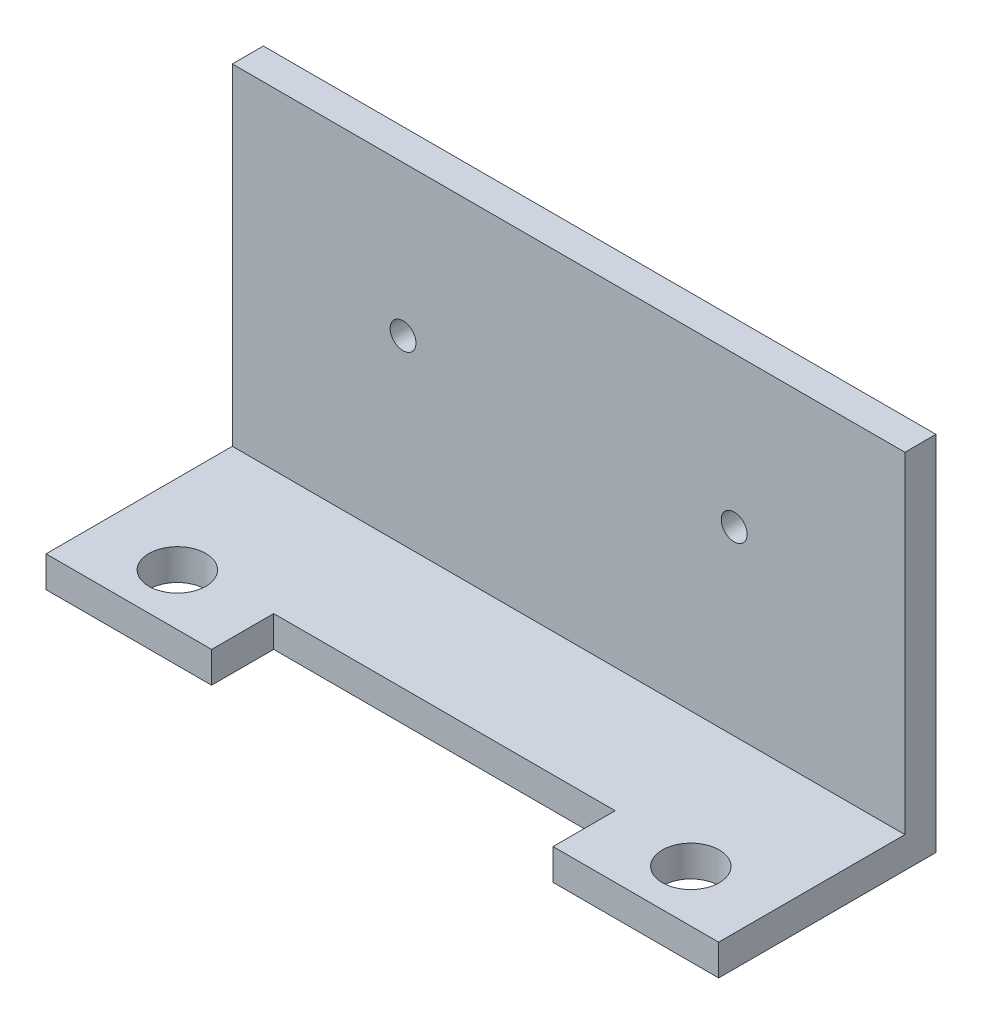
ISO-10303-21;
HEADER;
FILE_DESCRIPTION(('STEP AP214'),'2;1');
FILE_NAME('part.step','',(''),(''),'','','');
FILE_SCHEMA(('AUTOMOTIVE_DESIGN { 1 0 10303 214 1 1 1 1 }'));
ENDSEC;
DATA;
#1=APPLICATION_CONTEXT('core data for automotive mechanical design processes');
#2=APPLICATION_PROTOCOL_DEFINITION('international standard','automotive_design',2000,#1);
#3=PRODUCT_CONTEXT('',#1,'mechanical');
#4=PRODUCT('Part','Part','',(#3));
#5=PRODUCT_RELATED_PRODUCT_CATEGORY('part','',(#4));
#6=PRODUCT_DEFINITION_FORMATION('','',#4);
#7=PRODUCT_DEFINITION_CONTEXT('part definition',#1,'design');
#8=PRODUCT_DEFINITION('design','',#6,#7);
#9=PRODUCT_DEFINITION_SHAPE('','',#8);
#10=(LENGTH_UNIT() NAMED_UNIT(*) SI_UNIT(.MILLI.,.METRE.));
#11=(NAMED_UNIT(*) PLANE_ANGLE_UNIT() SI_UNIT($,.RADIAN.));
#12=(NAMED_UNIT(*) SI_UNIT($,.STERADIAN.) SOLID_ANGLE_UNIT());
#13=UNCERTAINTY_MEASURE_WITH_UNIT(LENGTH_MEASURE(1.E-05),#10,'distance_accuracy_value','');
#14=(GEOMETRIC_REPRESENTATION_CONTEXT(3) GLOBAL_UNCERTAINTY_ASSIGNED_CONTEXT((#13)) GLOBAL_UNIT_ASSIGNED_CONTEXT((#10,
#11,#12)) REPRESENTATION_CONTEXT('',''));
#15=CARTESIAN_POINT('',(0.,0.,0.));
#16=DIRECTION('',(0.,0.,1.));
#17=DIRECTION('',(1.,0.,0.));
#18=AXIS2_PLACEMENT_3D('',#15,#16,#17);
#19=CARTESIAN_POINT('',(0.,3.,0.));
#20=DIRECTION('',(0.,1.,0.));
#21=DIRECTION('',(0.,0.,1.));
#22=AXIS2_PLACEMENT_3D('',#19,#20,#21);
#23=PLANE('',#22);
#24=CARTESIAN_POINT('',(7.69,3.,-5.));
#25=DIRECTION('',(0.,1.,0.));
#26=DIRECTION('',(0.,0.,1.));
#27=AXIS2_PLACEMENT_3D('',#24,#25,#26);
#28=CIRCLE('',#27,2.75);
#29=CARTESIAN_POINT('',(7.69,3.,-2.25));
#30=VERTEX_POINT('',#29);
#31=EDGE_CURVE('E143',#30,#30,#28,.T.);
#32=ORIENTED_EDGE('',*,*,#31,.F.);
#33=EDGE_LOOP('',(#32));
#34=FACE_BOUND('',#33,.T.);
#35=DIRECTION('',(0.,0.,1.));
#36=VECTOR('',#35,1.);
#37=CARTESIAN_POINT('',(0.,3.,-18.));
#38=LINE('',#37,#36);
#39=CARTESIAN_POINT('',(0.,3.,-18.));
#40=VERTEX_POINT('',#39);
#41=CARTESIAN_POINT('',(0.,3.,0.));
#42=VERTEX_POINT('',#41);
#43=EDGE_CURVE('E160',#40,#42,#38,.T.);
#44=ORIENTED_EDGE('',*,*,#43,.T.);
#45=DIRECTION('',(1.,0.,0.));
#46=VECTOR('',#45,1.);
#47=CARTESIAN_POINT('',(0.,3.,0.));
#48=LINE('',#47,#46);
#49=CARTESIAN_POINT('',(16.,3.,0.));
#50=VERTEX_POINT('',#49);
#51=EDGE_CURVE('E96',#42,#50,#48,.T.);
#52=ORIENTED_EDGE('',*,*,#51,.T.);
#53=DIRECTION('',(0.,0.,-1.));
#54=VECTOR('',#53,1.);
#55=CARTESIAN_POINT('',(16.,3.,0.));
#56=LINE('',#55,#54);
#57=CARTESIAN_POINT('',(16.,3.,-6.));
#58=VERTEX_POINT('',#57);
#59=EDGE_CURVE('E175',#50,#58,#56,.T.);
#60=ORIENTED_EDGE('',*,*,#59,.T.);
#61=DIRECTION('',(1.,0.,0.));
#62=VECTOR('',#61,1.);
#63=CARTESIAN_POINT('',(16.,3.,-6.));
#64=LINE('',#63,#62);
#65=CARTESIAN_POINT('',(49.,3.,-6.));
#66=VERTEX_POINT('',#65);
#67=EDGE_CURVE('E116',#58,#66,#64,.T.);
#68=ORIENTED_EDGE('',*,*,#67,.T.);
#69=DIRECTION('',(0.,0.,1.));
#70=VECTOR('',#69,1.);
#71=CARTESIAN_POINT('',(49.,3.,-6.));
#72=LINE('',#71,#70);
#73=CARTESIAN_POINT('',(49.,3.,0.));
#74=VERTEX_POINT('',#73);
#75=EDGE_CURVE('E110',#66,#74,#72,.T.);
#76=ORIENTED_EDGE('',*,*,#75,.T.);
#77=DIRECTION('',(1.,0.,0.));
#78=VECTOR('',#77,1.);
#79=CARTESIAN_POINT('',(49.,3.,0.));
#80=LINE('',#79,#78);
#81=CARTESIAN_POINT('',(65.,3.,0.));
#82=VERTEX_POINT('',#81);
#83=EDGE_CURVE('E114',#74,#82,#80,.T.);
#84=ORIENTED_EDGE('',*,*,#83,.T.);
#85=DIRECTION('',(0.,0.,-1.));
#86=VECTOR('',#85,1.);
#87=CARTESIAN_POINT('',(65.,3.,0.));
#88=LINE('',#87,#86);
#89=CARTESIAN_POINT('',(65.,3.,-18.));
#90=VERTEX_POINT('',#89);
#91=EDGE_CURVE('E129',#82,#90,#88,.T.);
#92=ORIENTED_EDGE('',*,*,#91,.T.);
#93=DIRECTION('',(-1.,0.,0.));
#94=VECTOR('',#93,1.);
#95=CARTESIAN_POINT('',(65.,3.,-18.));
#96=LINE('',#95,#94);
#97=EDGE_CURVE('E132',#90,#40,#96,.T.);
#98=ORIENTED_EDGE('',*,*,#97,.T.);
#99=EDGE_LOOP('',(#44,#52,#60,#68,#76,#84,#92,#98));
#100=FACE_BOUND('',#99,.T.);
#101=CARTESIAN_POINT('',(57.31,3.,-5.00000000000001));
#102=DIRECTION('',(0.,1.,0.));
#103=DIRECTION('',(0.,0.,1.));
#104=AXIS2_PLACEMENT_3D('',#101,#102,#103);
#105=CIRCLE('',#104,2.75);
#106=CARTESIAN_POINT('',(57.31,3.,-2.25));
#107=VERTEX_POINT('',#106);
#108=EDGE_CURVE('E195',#107,#107,#105,.T.);
#109=ORIENTED_EDGE('',*,*,#108,.F.);
#110=EDGE_LOOP('',(#109));
#111=FACE_BOUND('',#110,.T.);
#112=ADVANCED_FACE('F38',(#34,#100,#111),#23,.T.);
#113=CARTESIAN_POINT('',(0.,0.,0.));
#114=DIRECTION('',(0.,1.,0.));
#115=DIRECTION('',(0.,0.,1.));
#116=AXIS2_PLACEMENT_3D('',#113,#114,#115);
#117=PLANE('',#116);
#118=DIRECTION('',(0.,0.,1.));
#119=VECTOR('',#118,1.);
#120=CARTESIAN_POINT('',(0.,0.,-18.));
#121=LINE('',#120,#119);
#122=CARTESIAN_POINT('',(0.,0.,-21.));
#123=VERTEX_POINT('',#122);
#124=CARTESIAN_POINT('',(0.,0.,0.));
#125=VERTEX_POINT('',#124);
#126=EDGE_CURVE('E138',#123,#125,#121,.T.);
#127=ORIENTED_EDGE('',*,*,#126,.F.);
#128=DIRECTION('',(-1.,0.,0.));
#129=VECTOR('',#128,1.);
#130=CARTESIAN_POINT('',(0.,0.,-21.));
#131=LINE('',#130,#129);
#132=CARTESIAN_POINT('',(65.,0.,-21.));
#133=VERTEX_POINT('',#132);
#134=EDGE_CURVE('E221',#133,#123,#131,.T.);
#135=ORIENTED_EDGE('',*,*,#134,.F.);
#136=DIRECTION('',(0.,0.,-1.));
#137=VECTOR('',#136,1.);
#138=CARTESIAN_POINT('',(65.,0.,0.));
#139=LINE('',#138,#137);
#140=CARTESIAN_POINT('',(65.,0.,0.));
#141=VERTEX_POINT('',#140);
#142=EDGE_CURVE('E156',#141,#133,#139,.T.);
#143=ORIENTED_EDGE('',*,*,#142,.F.);
#144=DIRECTION('',(1.,0.,0.));
#145=VECTOR('',#144,1.);
#146=CARTESIAN_POINT('',(49.,0.,0.));
#147=LINE('',#146,#145);
#148=CARTESIAN_POINT('',(49.,0.,0.));
#149=VERTEX_POINT('',#148);
#150=EDGE_CURVE('E88',#149,#141,#147,.T.);
#151=ORIENTED_EDGE('',*,*,#150,.F.);
#152=DIRECTION('',(0.,0.,1.));
#153=VECTOR('',#152,1.);
#154=CARTESIAN_POINT('',(49.,0.,-6.));
#155=LINE('',#154,#153);
#156=CARTESIAN_POINT('',(49.,0.,-6.));
#157=VERTEX_POINT('',#156);
#158=EDGE_CURVE('E81',#157,#149,#155,.T.);
#159=ORIENTED_EDGE('',*,*,#158,.F.);
#160=DIRECTION('',(1.,0.,0.));
#161=VECTOR('',#160,1.);
#162=CARTESIAN_POINT('',(16.,0.,-6.));
#163=LINE('',#162,#161);
#164=CARTESIAN_POINT('',(16.,0.,-6.));
#165=VERTEX_POINT('',#164);
#166=EDGE_CURVE('E149',#165,#157,#163,.T.);
#167=ORIENTED_EDGE('',*,*,#166,.F.);
#168=DIRECTION('',(0.,0.,-1.));
#169=VECTOR('',#168,1.);
#170=CARTESIAN_POINT('',(16.,0.,0.));
#171=LINE('',#170,#169);
#172=CARTESIAN_POINT('',(16.,0.,0.));
#173=VERTEX_POINT('',#172);
#174=EDGE_CURVE('E146',#173,#165,#171,.T.);
#175=ORIENTED_EDGE('',*,*,#174,.F.);
#176=DIRECTION('',(1.,0.,0.));
#177=VECTOR('',#176,1.);
#178=CARTESIAN_POINT('',(0.,0.,0.));
#179=LINE('',#178,#177);
#180=EDGE_CURVE('E142',#125,#173,#179,.T.);
#181=ORIENTED_EDGE('',*,*,#180,.F.);
#182=EDGE_LOOP('',(#127,#135,#143,#151,#159,#167,#175,#181));
#183=FACE_BOUND('',#182,.T.);
#184=CARTESIAN_POINT('',(7.69,0.,-5.));
#185=DIRECTION('',(0.,1.,0.));
#186=DIRECTION('',(0.,0.,1.));
#187=AXIS2_PLACEMENT_3D('',#184,#185,#186);
#188=CIRCLE('',#187,2.75);
#189=CARTESIAN_POINT('',(7.69,0.,-2.25));
#190=VERTEX_POINT('',#189);
#191=EDGE_CURVE('E191',#190,#190,#188,.T.);
#192=ORIENTED_EDGE('',*,*,#191,.T.);
#193=EDGE_LOOP('',(#192));
#194=FACE_BOUND('',#193,.T.);
#195=CARTESIAN_POINT('',(57.31,0.,-5.00000000000001));
#196=DIRECTION('',(0.,1.,0.));
#197=DIRECTION('',(0.,0.,1.));
#198=AXIS2_PLACEMENT_3D('',#195,#196,#197);
#199=CIRCLE('',#198,2.75);
#200=CARTESIAN_POINT('',(57.31,0.,-2.25));
#201=VERTEX_POINT('',#200);
#202=EDGE_CURVE('E199',#201,#201,#199,.T.);
#203=ORIENTED_EDGE('',*,*,#202,.T.);
#204=EDGE_LOOP('',(#203));
#205=FACE_BOUND('',#204,.T.);
#206=ADVANCED_FACE('F179',(#183,#194,#205),#117,.F.);
#207=CARTESIAN_POINT('',(0.,3.,-18.));
#208=DIRECTION('',(1.,0.,0.));
#209=DIRECTION('',(0.,0.,-1.));
#210=AXIS2_PLACEMENT_3D('',#207,#208,#209);
#211=PLANE('',#210);
#212=ORIENTED_EDGE('',*,*,#126,.T.);
#213=DIRECTION('',(0.,-1.,0.));
#214=VECTOR('',#213,1.);
#215=CARTESIAN_POINT('',(0.,3.,0.));
#216=LINE('',#215,#214);
#217=EDGE_CURVE('E11',#42,#125,#216,.T.);
#218=ORIENTED_EDGE('',*,*,#217,.F.);
#219=ORIENTED_EDGE('',*,*,#43,.F.);
#220=DIRECTION('',(0.,-1.,0.));
#221=VECTOR('',#220,1.);
#222=CARTESIAN_POINT('',(0.,35.,-18.));
#223=LINE('',#222,#221);
#224=CARTESIAN_POINT('',(0.,35.,-18.));
#225=VERTEX_POINT('',#224);
#226=EDGE_CURVE('E56',#225,#40,#223,.T.);
#227=ORIENTED_EDGE('',*,*,#226,.F.);
#228=DIRECTION('',(0.,0.,1.));
#229=VECTOR('',#228,1.);
#230=CARTESIAN_POINT('',(0.,35.,-18.));
#231=LINE('',#230,#229);
#232=CARTESIAN_POINT('',(0.,35.,-21.));
#233=VERTEX_POINT('',#232);
#234=EDGE_CURVE('E225',#233,#225,#231,.T.);
#235=ORIENTED_EDGE('',*,*,#234,.F.);
#236=DIRECTION('',(0.,-1.,0.));
#237=VECTOR('',#236,1.);
#238=CARTESIAN_POINT('',(0.,35.,-21.));
#239=LINE('',#238,#237);
#240=EDGE_CURVE('E216',#233,#123,#239,.T.);
#241=ORIENTED_EDGE('',*,*,#240,.T.);
#242=EDGE_LOOP('',(#212,#218,#219,#227,#235,#241));
#243=FACE_BOUND('',#242,.T.);
#244=ADVANCED_FACE('F40',(#243),#211,.F.);
#245=CARTESIAN_POINT('',(0.,3.,0.));
#246=DIRECTION('',(0.,0.,-1.));
#247=DIRECTION('',(-1.,0.,0.));
#248=AXIS2_PLACEMENT_3D('',#245,#246,#247);
#249=PLANE('',#248);
#250=ORIENTED_EDGE('',*,*,#180,.T.);
#251=DIRECTION('',(0.,-1.,0.));
#252=VECTOR('',#251,1.);
#253=CARTESIAN_POINT('',(16.,3.,0.));
#254=LINE('',#253,#252);
#255=EDGE_CURVE('E48',#50,#173,#254,.T.);
#256=ORIENTED_EDGE('',*,*,#255,.F.);
#257=ORIENTED_EDGE('',*,*,#51,.F.);
#258=ORIENTED_EDGE('',*,*,#217,.T.);
#259=EDGE_LOOP('',(#250,#256,#257,#258));
#260=FACE_BOUND('',#259,.T.);
#261=ADVANCED_FACE('F298',(#260),#249,.F.);
#262=CARTESIAN_POINT('',(16.,3.,0.));
#263=DIRECTION('',(-1.,0.,0.));
#264=DIRECTION('',(0.,0.,1.));
#265=AXIS2_PLACEMENT_3D('',#262,#263,#264);
#266=PLANE('',#265);
#267=ORIENTED_EDGE('',*,*,#174,.T.);
#268=DIRECTION('',(0.,-1.,0.));
#269=VECTOR('',#268,1.);
#270=CARTESIAN_POINT('',(16.,3.,-6.));
#271=LINE('',#270,#269);
#272=EDGE_CURVE('E165',#58,#165,#271,.T.);
#273=ORIENTED_EDGE('',*,*,#272,.F.);
#274=ORIENTED_EDGE('',*,*,#59,.F.);
#275=ORIENTED_EDGE('',*,*,#255,.T.);
#276=EDGE_LOOP('',(#267,#273,#274,#275));
#277=FACE_BOUND('',#276,.T.);
#278=ADVANCED_FACE('F173',(#277),#266,.F.);
#279=CARTESIAN_POINT('',(16.,3.,-6.));
#280=DIRECTION('',(0.,0.,-1.));
#281=DIRECTION('',(-1.,0.,0.));
#282=AXIS2_PLACEMENT_3D('',#279,#280,#281);
#283=PLANE('',#282);
#284=ORIENTED_EDGE('',*,*,#166,.T.);
#285=DIRECTION('',(0.,-1.,0.));
#286=VECTOR('',#285,1.);
#287=CARTESIAN_POINT('',(49.,3.,-6.));
#288=LINE('',#287,#286);
#289=EDGE_CURVE('E123',#66,#157,#288,.T.);
#290=ORIENTED_EDGE('',*,*,#289,.F.);
#291=ORIENTED_EDGE('',*,*,#67,.F.);
#292=ORIENTED_EDGE('',*,*,#272,.T.);
#293=EDGE_LOOP('',(#284,#290,#291,#292));
#294=FACE_BOUND('',#293,.T.);
#295=ADVANCED_FACE('F182',(#294),#283,.F.);
#296=CARTESIAN_POINT('',(49.,3.,-6.));
#297=DIRECTION('',(1.,0.,0.));
#298=DIRECTION('',(0.,0.,-1.));
#299=AXIS2_PLACEMENT_3D('',#296,#297,#298);
#300=PLANE('',#299);
#301=ORIENTED_EDGE('',*,*,#158,.T.);
#302=DIRECTION('',(0.,-1.,0.));
#303=VECTOR('',#302,1.);
#304=CARTESIAN_POINT('',(49.,3.,0.));
#305=LINE('',#304,#303);
#306=EDGE_CURVE('E120',#74,#149,#305,.T.);
#307=ORIENTED_EDGE('',*,*,#306,.F.);
#308=ORIENTED_EDGE('',*,*,#75,.F.);
#309=ORIENTED_EDGE('',*,*,#289,.T.);
#310=EDGE_LOOP('',(#301,#307,#308,#309));
#311=FACE_BOUND('',#310,.T.);
#312=ADVANCED_FACE('F121',(#311),#300,.F.);
#313=CARTESIAN_POINT('',(49.,3.,0.));
#314=DIRECTION('',(0.,0.,-1.));
#315=DIRECTION('',(-1.,0.,0.));
#316=AXIS2_PLACEMENT_3D('',#313,#314,#315);
#317=PLANE('',#316);
#318=ORIENTED_EDGE('',*,*,#150,.T.);
#319=DIRECTION('',(0.,-1.,0.));
#320=VECTOR('',#319,1.);
#321=CARTESIAN_POINT('',(65.,3.,0.));
#322=LINE('',#321,#320);
#323=EDGE_CURVE('E124',#82,#141,#322,.T.);
#324=ORIENTED_EDGE('',*,*,#323,.F.);
#325=ORIENTED_EDGE('',*,*,#83,.F.);
#326=ORIENTED_EDGE('',*,*,#306,.T.);
#327=EDGE_LOOP('',(#318,#324,#325,#326));
#328=FACE_BOUND('',#327,.T.);
#329=ADVANCED_FACE('F126',(#328),#317,.F.);
#330=CARTESIAN_POINT('',(65.,3.,0.));
#331=DIRECTION('',(-1.,0.,0.));
#332=DIRECTION('',(0.,0.,1.));
#333=AXIS2_PLACEMENT_3D('',#330,#331,#332);
#334=PLANE('',#333);
#335=ORIENTED_EDGE('',*,*,#142,.T.);
#336=DIRECTION('',(0.,-1.,0.));
#337=VECTOR('',#336,1.);
#338=CARTESIAN_POINT('',(65.,35.,-21.));
#339=LINE('',#338,#337);
#340=CARTESIAN_POINT('',(65.,35.,-21.));
#341=VERTEX_POINT('',#340);
#342=EDGE_CURVE('E212',#341,#133,#339,.T.);
#343=ORIENTED_EDGE('',*,*,#342,.F.);
#344=DIRECTION('',(0.,0.,-1.));
#345=VECTOR('',#344,1.);
#346=CARTESIAN_POINT('',(65.,35.,-18.));
#347=LINE('',#346,#345);
#348=CARTESIAN_POINT('',(65.,35.,-18.));
#349=VERTEX_POINT('',#348);
#350=EDGE_CURVE('E230',#349,#341,#347,.T.);
#351=ORIENTED_EDGE('',*,*,#350,.F.);
#352=DIRECTION('',(0.,-1.,0.));
#353=VECTOR('',#352,1.);
#354=CARTESIAN_POINT('',(65.,35.,-18.));
#355=LINE('',#354,#353);
#356=EDGE_CURVE('E208',#349,#90,#355,.T.);
#357=ORIENTED_EDGE('',*,*,#356,.T.);
#358=ORIENTED_EDGE('',*,*,#91,.F.);
#359=ORIENTED_EDGE('',*,*,#323,.T.);
#360=EDGE_LOOP('',(#335,#343,#351,#357,#358,#359));
#361=FACE_BOUND('',#360,.T.);
#362=ADVANCED_FACE('F279',(#361),#334,.F.);
#363=CARTESIAN_POINT('',(7.69,3.,-5.));
#364=DIRECTION('',(0.,-1.,0.));
#365=DIRECTION('',(0.,0.,-1.));
#366=AXIS2_PLACEMENT_3D('',#363,#364,#365);
#367=CYLINDRICAL_SURFACE('',#366,2.75);
#368=ORIENTED_EDGE('',*,*,#31,.T.);
#369=EDGE_LOOP('',(#368));
#370=FACE_BOUND('',#369,.T.);
#371=ORIENTED_EDGE('',*,*,#191,.F.);
#372=EDGE_LOOP('',(#371));
#373=FACE_BOUND('',#372,.T.);
#374=ADVANCED_FACE('F314',(#370,#373),#367,.F.);
#375=CARTESIAN_POINT('',(57.31,3.,-5.00000000000001));
#376=DIRECTION('',(0.,-1.,0.));
#377=DIRECTION('',(0.,0.,-1.));
#378=AXIS2_PLACEMENT_3D('',#375,#376,#377);
#379=CYLINDRICAL_SURFACE('',#378,2.75);
#380=ORIENTED_EDGE('',*,*,#108,.T.);
#381=EDGE_LOOP('',(#380));
#382=FACE_BOUND('',#381,.T.);
#383=ORIENTED_EDGE('',*,*,#202,.F.);
#384=EDGE_LOOP('',(#383));
#385=FACE_BOUND('',#384,.T.);
#386=ADVANCED_FACE('F270',(#382,#385),#379,.F.);
#387=CARTESIAN_POINT('',(0.,35.,-18.));
#388=DIRECTION('',(0.,0.,-1.));
#389=DIRECTION('',(-1.,0.,0.));
#390=AXIS2_PLACEMENT_3D('',#387,#388,#389);
#391=PLANE('',#390);
#392=CARTESIAN_POINT('',(16.5,20.5,-18.));
#393=DIRECTION('',(0.,0.,1.));
#394=DIRECTION('',(1.,0.,0.));
#395=AXIS2_PLACEMENT_3D('',#392,#393,#394);
#396=CIRCLE('',#395,1.25);
#397=CARTESIAN_POINT('',(17.75,20.5,-18.));
#398=VERTEX_POINT('',#397);
#399=EDGE_CURVE('E249',#398,#398,#396,.T.);
#400=ORIENTED_EDGE('',*,*,#399,.F.);
#401=EDGE_LOOP('',(#400));
#402=FACE_BOUND('',#401,.T.);
#403=CARTESIAN_POINT('',(48.5,20.5,-18.));
#404=DIRECTION('',(0.,0.,1.));
#405=DIRECTION('',(1.,0.,0.));
#406=AXIS2_PLACEMENT_3D('',#403,#404,#405);
#407=CIRCLE('',#406,1.25);
#408=CARTESIAN_POINT('',(49.75,20.5,-18.));
#409=VERTEX_POINT('',#408);
#410=EDGE_CURVE('E241',#409,#409,#407,.T.);
#411=ORIENTED_EDGE('',*,*,#410,.F.);
#412=EDGE_LOOP('',(#411));
#413=FACE_BOUND('',#412,.T.);
#414=ORIENTED_EDGE('',*,*,#97,.F.);
#415=ORIENTED_EDGE('',*,*,#356,.F.);
#416=DIRECTION('',(1.,0.,0.));
#417=VECTOR('',#416,1.);
#418=CARTESIAN_POINT('',(0.,35.,-18.));
#419=LINE('',#418,#417);
#420=EDGE_CURVE('E234',#225,#349,#419,.T.);
#421=ORIENTED_EDGE('',*,*,#420,.F.);
#422=ORIENTED_EDGE('',*,*,#226,.T.);
#423=EDGE_LOOP('',(#414,#415,#421,#422));
#424=FACE_BOUND('',#423,.T.);
#425=ADVANCED_FACE('F267',(#402,#413,#424),#391,.F.);
#426=CARTESIAN_POINT('',(0.,35.,-21.));
#427=DIRECTION('',(0.,0.,1.));
#428=DIRECTION('',(1.,0.,0.));
#429=AXIS2_PLACEMENT_3D('',#426,#427,#428);
#430=PLANE('',#429);
#431=CARTESIAN_POINT('',(16.5,20.5,-21.));
#432=DIRECTION('',(0.,0.,1.));
#433=DIRECTION('',(1.,0.,0.));
#434=AXIS2_PLACEMENT_3D('',#431,#432,#433);
#435=CIRCLE('',#434,1.25);
#436=CARTESIAN_POINT('',(17.75,20.5,-21.));
#437=VERTEX_POINT('',#436);
#438=EDGE_CURVE('E226',#437,#437,#435,.T.);
#439=ORIENTED_EDGE('',*,*,#438,.T.);
#440=EDGE_LOOP('',(#439));
#441=FACE_BOUND('',#440,.T.);
#442=CARTESIAN_POINT('',(48.5,20.5,-21.));
#443=DIRECTION('',(0.,0.,1.));
#444=DIRECTION('',(1.,0.,0.));
#445=AXIS2_PLACEMENT_3D('',#442,#443,#444);
#446=CIRCLE('',#445,1.25);
#447=CARTESIAN_POINT('',(49.75,20.5,-21.));
#448=VERTEX_POINT('',#447);
#449=EDGE_CURVE('E245',#448,#448,#446,.T.);
#450=ORIENTED_EDGE('',*,*,#449,.T.);
#451=EDGE_LOOP('',(#450));
#452=FACE_BOUND('',#451,.T.);
#453=ORIENTED_EDGE('',*,*,#134,.T.);
#454=ORIENTED_EDGE('',*,*,#240,.F.);
#455=DIRECTION('',(-1.,0.,0.));
#456=VECTOR('',#455,1.);
#457=CARTESIAN_POINT('',(0.,35.,-21.));
#458=LINE('',#457,#456);
#459=EDGE_CURVE('E220',#341,#233,#458,.T.);
#460=ORIENTED_EDGE('',*,*,#459,.F.);
#461=ORIENTED_EDGE('',*,*,#342,.T.);
#462=EDGE_LOOP('',(#453,#454,#460,#461));
#463=FACE_BOUND('',#462,.T.);
#464=ADVANCED_FACE('F257',(#441,#452,#463),#430,.F.);
#465=CARTESIAN_POINT('',(0.,35.,0.));
#466=DIRECTION('',(0.,-1.,0.));
#467=DIRECTION('',(0.,0.,-1.));
#468=AXIS2_PLACEMENT_3D('',#465,#466,#467);
#469=PLANE('',#468);
#470=ORIENTED_EDGE('',*,*,#234,.T.);
#471=ORIENTED_EDGE('',*,*,#420,.T.);
#472=ORIENTED_EDGE('',*,*,#350,.T.);
#473=ORIENTED_EDGE('',*,*,#459,.T.);
#474=EDGE_LOOP('',(#470,#471,#472,#473));
#475=FACE_BOUND('',#474,.T.);
#476=ADVANCED_FACE('F286',(#475),#469,.F.);
#477=CARTESIAN_POINT('',(48.5,20.5,-21.));
#478=DIRECTION('',(0.,0.,1.));
#479=DIRECTION('',(1.,0.,0.));
#480=AXIS2_PLACEMENT_3D('',#477,#478,#479);
#481=CYLINDRICAL_SURFACE('',#480,1.25);
#482=ORIENTED_EDGE('',*,*,#449,.F.);
#483=EDGE_LOOP('',(#482));
#484=FACE_BOUND('',#483,.T.);
#485=ORIENTED_EDGE('',*,*,#410,.T.);
#486=EDGE_LOOP('',(#485));
#487=FACE_BOUND('',#486,.T.);
#488=ADVANCED_FACE('F263',(#484,#487),#481,.F.);
#489=CARTESIAN_POINT('',(16.5,20.5,-21.));
#490=DIRECTION('',(0.,0.,1.));
#491=DIRECTION('',(1.,0.,0.));
#492=AXIS2_PLACEMENT_3D('',#489,#490,#491);
#493=CYLINDRICAL_SURFACE('',#492,1.25);
#494=ORIENTED_EDGE('',*,*,#438,.F.);
#495=EDGE_LOOP('',(#494));
#496=FACE_BOUND('',#495,.T.);
#497=ORIENTED_EDGE('',*,*,#399,.T.);
#498=EDGE_LOOP('',(#497));
#499=FACE_BOUND('',#498,.T.);
#500=ADVANCED_FACE('F260',(#496,#499),#493,.F.);
#501=CLOSED_SHELL('',(#112,#206,#244,#261,#278,#295,#312,#329,#362,#374,#386,#425,#464,#476,
#488,#500));
#502=MANIFOLD_SOLID_BREP('B2',#501);
#503=ADVANCED_BREP_SHAPE_REPRESENTATION('',(#18,#502),#14);
#504=SHAPE_DEFINITION_REPRESENTATION(#9,#503);
ENDSEC;
END-ISO-10303-21;
